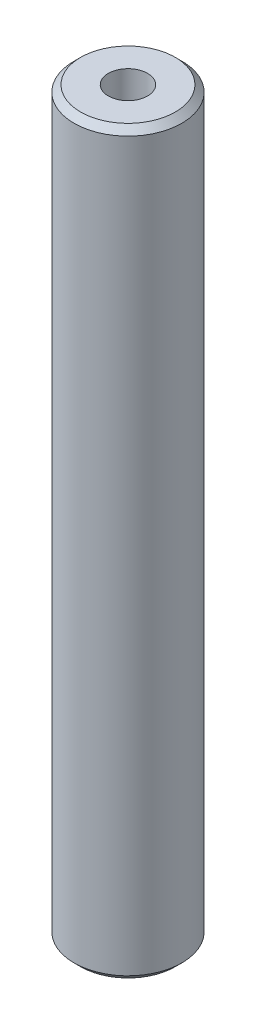
ISO-10303-21;
HEADER;
FILE_DESCRIPTION(('STEP AP214'),'2;1');
FILE_NAME('part.step','',(''),(''),'','','');
FILE_SCHEMA(('AUTOMOTIVE_DESIGN { 1 0 10303 214 1 1 1 1 }'));
ENDSEC;
DATA;
#1=APPLICATION_CONTEXT('core data for automotive mechanical design processes');
#2=APPLICATION_PROTOCOL_DEFINITION('international standard','automotive_design',2000,#1);
#3=PRODUCT_CONTEXT('',#1,'mechanical');
#4=PRODUCT('Part','Part','',(#3));
#5=PRODUCT_RELATED_PRODUCT_CATEGORY('part','',(#4));
#6=PRODUCT_DEFINITION_FORMATION('','',#4);
#7=PRODUCT_DEFINITION_CONTEXT('part definition',#1,'design');
#8=PRODUCT_DEFINITION('design','',#6,#7);
#9=PRODUCT_DEFINITION_SHAPE('','',#8);
#10=(LENGTH_UNIT() NAMED_UNIT(*) SI_UNIT(.MILLI.,.METRE.));
#11=(NAMED_UNIT(*) PLANE_ANGLE_UNIT() SI_UNIT($,.RADIAN.));
#12=(NAMED_UNIT(*) SI_UNIT($,.STERADIAN.) SOLID_ANGLE_UNIT());
#13=UNCERTAINTY_MEASURE_WITH_UNIT(LENGTH_MEASURE(1.E-05),#10,'distance_accuracy_value','');
#14=(GEOMETRIC_REPRESENTATION_CONTEXT(3) GLOBAL_UNCERTAINTY_ASSIGNED_CONTEXT((#13)) GLOBAL_UNIT_ASSIGNED_CONTEXT((#10,
#11,#12)) REPRESENTATION_CONTEXT('',''));
#15=CARTESIAN_POINT('',(0.,0.,0.));
#16=DIRECTION('',(0.,0.,1.));
#17=DIRECTION('',(1.,0.,0.));
#18=AXIS2_PLACEMENT_3D('',#15,#16,#17);
#19=CARTESIAN_POINT('',(0.,480.846947887951,0.));
#20=DIRECTION('',(0.,-1.,0.));
#21=DIRECTION('',(0.,0.,-1.));
#22=AXIS2_PLACEMENT_3D('',#19,#20,#21);
#23=CYLINDRICAL_SURFACE('',#22,35.);
#24=CARTESIAN_POINT('',(0.,476.623712619582,0.));
#25=DIRECTION('',(0.,1.,0.));
#26=DIRECTION('',(0.,0.,1.));
#27=AXIS2_PLACEMENT_3D('',#24,#25,#26);
#28=CIRCLE('',#27,35.);
#29=CARTESIAN_POINT('',(0.,476.623712619582,35.));
#30=VERTEX_POINT('',#29);
#31=EDGE_CURVE('E50',#30,#30,#28,.F.);
#32=ORIENTED_EDGE('',*,*,#31,.T.);
#33=EDGE_LOOP('',(#32));
#34=FACE_BOUND('',#33,.T.);
#35=CARTESIAN_POINT('',(0.,4.22323526836915,0.));
#36=DIRECTION('',(0.,1.,0.));
#37=DIRECTION('',(0.,0.,1.));
#38=AXIS2_PLACEMENT_3D('',#35,#36,#37);
#39=CIRCLE('',#38,35.);
#40=CARTESIAN_POINT('',(0.,4.22323526836915,35.));
#41=VERTEX_POINT('',#40);
#42=EDGE_CURVE('E51',#41,#41,#39,.T.);
#43=ORIENTED_EDGE('',*,*,#42,.T.);
#44=EDGE_LOOP('',(#43));
#45=FACE_BOUND('',#44,.T.);
#46=ADVANCED_FACE('F39',(#34,#45),#23,.T.);
#47=CARTESIAN_POINT('',(0.,480.846947887951,0.));
#48=DIRECTION('',(0.,1.,0.));
#49=DIRECTION('',(0.,0.,1.));
#50=AXIS2_PLACEMENT_3D('',#47,#48,#49);
#51=PLANE('',#50);
#52=CARTESIAN_POINT('',(0.,480.846947887951,0.));
#53=DIRECTION('',(0.,1.,0.));
#54=DIRECTION('',(0.,0.,1.));
#55=AXIS2_PLACEMENT_3D('',#52,#53,#54);
#56=CIRCLE('',#55,30.7767647316309);
#57=CARTESIAN_POINT('',(0.,480.846947887951,30.7767647316309));
#58=VERTEX_POINT('',#57);
#59=EDGE_CURVE('E54',#58,#58,#56,.T.);
#60=ORIENTED_EDGE('',*,*,#59,.T.);
#61=EDGE_LOOP('',(#60));
#62=FACE_BOUND('',#61,.T.);
#63=CARTESIAN_POINT('',(0.,480.846947887951,0.));
#64=DIRECTION('',(0.,1.,0.));
#65=DIRECTION('',(0.,0.,1.));
#66=AXIS2_PLACEMENT_3D('',#63,#64,#65);
#67=CIRCLE('',#66,12.7482828784081);
#68=CARTESIAN_POINT('',(0.,480.846947887951,12.7482828784081));
#69=VERTEX_POINT('',#68);
#70=EDGE_CURVE('E58',#69,#69,#67,.T.);
#71=ORIENTED_EDGE('',*,*,#70,.F.);
#72=EDGE_LOOP('',(#71));
#73=FACE_BOUND('',#72,.T.);
#74=ADVANCED_FACE('F69',(#62,#73),#51,.T.);
#75=CARTESIAN_POINT('',(0.,0.,0.));
#76=DIRECTION('',(0.,1.,0.));
#77=DIRECTION('',(0.,0.,1.));
#78=AXIS2_PLACEMENT_3D('',#75,#76,#77);
#79=PLANE('',#78);
#80=CARTESIAN_POINT('',(0.,0.,0.));
#81=DIRECTION('',(0.,1.,0.));
#82=DIRECTION('',(0.,0.,1.));
#83=AXIS2_PLACEMENT_3D('',#80,#81,#82);
#84=CIRCLE('',#83,30.7767647316308);
#85=CARTESIAN_POINT('',(0.,0.,30.7767647316308));
#86=VERTEX_POINT('',#85);
#87=EDGE_CURVE('E10',#86,#86,#84,.F.);
#88=ORIENTED_EDGE('',*,*,#87,.T.);
#89=EDGE_LOOP('',(#88));
#90=FACE_BOUND('',#89,.T.);
#91=CARTESIAN_POINT('',(0.,0.,0.));
#92=DIRECTION('',(0.,1.,0.));
#93=DIRECTION('',(0.,0.,1.));
#94=AXIS2_PLACEMENT_3D('',#91,#92,#93);
#95=CIRCLE('',#94,12.7482828784081);
#96=CARTESIAN_POINT('',(0.,0.,12.7482828784081));
#97=VERTEX_POINT('',#96);
#98=EDGE_CURVE('E63',#97,#97,#95,.T.);
#99=ORIENTED_EDGE('',*,*,#98,.T.);
#100=EDGE_LOOP('',(#99));
#101=FACE_BOUND('',#100,.T.);
#102=ADVANCED_FACE('F75',(#90,#101),#79,.F.);
#103=CARTESIAN_POINT('',(0.,480.846947887951,0.));
#104=DIRECTION('',(0.,-1.,0.));
#105=DIRECTION('',(0.,0.,-1.));
#106=AXIS2_PLACEMENT_3D('',#103,#104,#105);
#107=CYLINDRICAL_SURFACE('',#106,12.7482828784081);
#108=ORIENTED_EDGE('',*,*,#70,.T.);
#109=EDGE_LOOP('',(#108));
#110=FACE_BOUND('',#109,.T.);
#111=ORIENTED_EDGE('',*,*,#98,.F.);
#112=EDGE_LOOP('',(#111));
#113=FACE_BOUND('',#112,.T.);
#114=ADVANCED_FACE('F70',(#110,#113),#107,.F.);
#115=CARTESIAN_POINT('',(0.,480.846947887951,0.));
#116=DIRECTION('',(0.,-1.,0.));
#117=DIRECTION('',(0.,0.,-1.));
#118=AXIS2_PLACEMENT_3D('',#115,#116,#117);
#119=CONICAL_SURFACE('',#118,30.7767647316309,0.785398163397439);
#120=ORIENTED_EDGE('',*,*,#31,.F.);
#121=EDGE_LOOP('',(#120));
#122=FACE_BOUND('',#121,.T.);
#123=ORIENTED_EDGE('',*,*,#59,.F.);
#124=EDGE_LOOP('',(#123));
#125=FACE_BOUND('',#124,.T.);
#126=ADVANCED_FACE('F81',(#122,#125),#119,.T.);
#127=CARTESIAN_POINT('',(0.,4.22323526836915,0.));
#128=DIRECTION('',(0.,1.,0.));
#129=DIRECTION('',(0.,0.,1.));
#130=AXIS2_PLACEMENT_3D('',#127,#128,#129);
#131=CONICAL_SURFACE('',#130,35.,0.785398163397452);
#132=ORIENTED_EDGE('',*,*,#87,.F.);
#133=EDGE_LOOP('',(#132));
#134=FACE_BOUND('',#133,.T.);
#135=ORIENTED_EDGE('',*,*,#42,.F.);
#136=EDGE_LOOP('',(#135));
#137=FACE_BOUND('',#136,.T.);
#138=ADVANCED_FACE('F45',(#134,#137),#131,.T.);
#139=CLOSED_SHELL('',(#46,#74,#102,#114,#126,#138));
#140=MANIFOLD_SOLID_BREP('B2',#139);
#141=ADVANCED_BREP_SHAPE_REPRESENTATION('',(#18,#140),#14);
#142=SHAPE_DEFINITION_REPRESENTATION(#9,#141);
ENDSEC;
END-ISO-10303-21;
